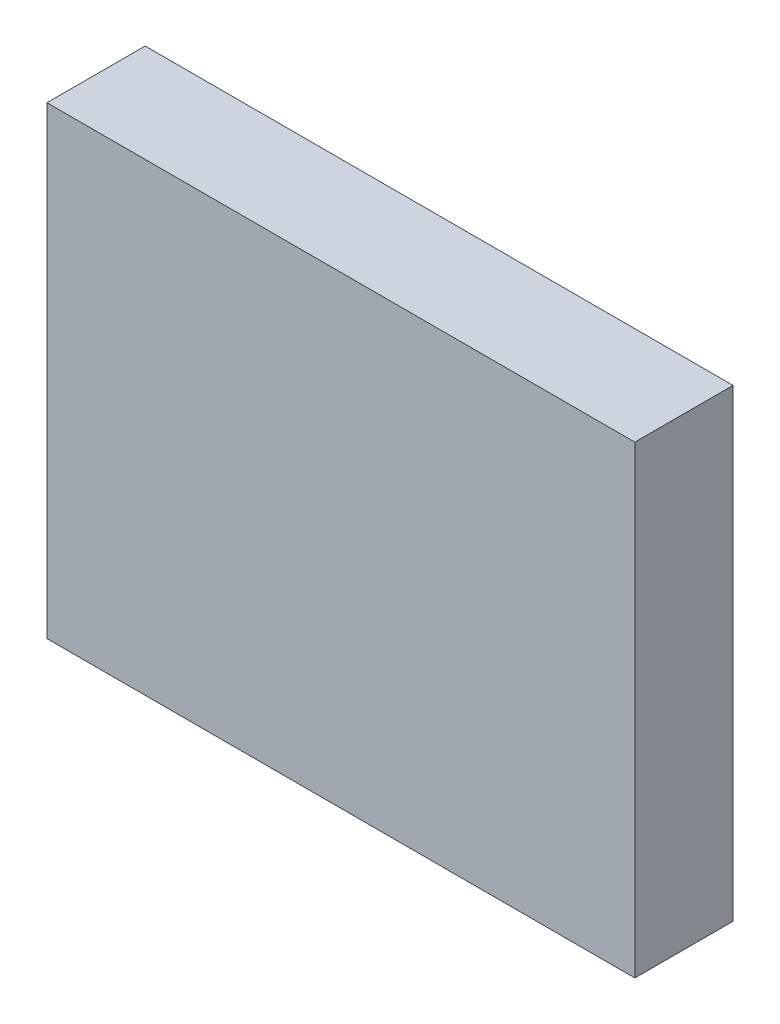
ISO-10303-21;
HEADER;
FILE_DESCRIPTION(('STEP AP214'),'2;1');
FILE_NAME('part.step','',(''),(''),'','','');
FILE_SCHEMA(('AUTOMOTIVE_DESIGN { 1 0 10303 214 1 1 1 1 }'));
ENDSEC;
DATA;
#1=APPLICATION_CONTEXT('core data for automotive mechanical design processes');
#2=APPLICATION_PROTOCOL_DEFINITION('international standard','automotive_design',2000,#1);
#3=PRODUCT_CONTEXT('',#1,'mechanical');
#4=PRODUCT('Part','Part','',(#3));
#5=PRODUCT_RELATED_PRODUCT_CATEGORY('part','',(#4));
#6=PRODUCT_DEFINITION_FORMATION('','',#4);
#7=PRODUCT_DEFINITION_CONTEXT('part definition',#1,'design');
#8=PRODUCT_DEFINITION('design','',#6,#7);
#9=PRODUCT_DEFINITION_SHAPE('','',#8);
#10=(LENGTH_UNIT() NAMED_UNIT(*) SI_UNIT(.MILLI.,.METRE.));
#11=(NAMED_UNIT(*) PLANE_ANGLE_UNIT() SI_UNIT($,.RADIAN.));
#12=(NAMED_UNIT(*) SI_UNIT($,.STERADIAN.) SOLID_ANGLE_UNIT());
#13=UNCERTAINTY_MEASURE_WITH_UNIT(LENGTH_MEASURE(1.E-05),#10,'distance_accuracy_value','');
#14=(GEOMETRIC_REPRESENTATION_CONTEXT(3) GLOBAL_UNCERTAINTY_ASSIGNED_CONTEXT((#13)) GLOBAL_UNIT_ASSIGNED_CONTEXT((#10,
#11,#12)) REPRESENTATION_CONTEXT('',''));
#15=CARTESIAN_POINT('',(0.,0.,0.));
#16=DIRECTION('',(0.,0.,1.));
#17=DIRECTION('',(1.,0.,0.));
#18=AXIS2_PLACEMENT_3D('',#15,#16,#17);
#19=CARTESIAN_POINT('',(19.,-15.,6.35));
#20=DIRECTION('',(-1.,0.,0.));
#21=DIRECTION('',(0.,0.,1.));
#22=AXIS2_PLACEMENT_3D('',#19,#20,#21);
#23=PLANE('',#22);
#24=DIRECTION('',(0.,1.,0.));
#25=VECTOR('',#24,1.);
#26=CARTESIAN_POINT('',(19.,-15.,0.));
#27=LINE('',#26,#25);
#28=CARTESIAN_POINT('',(19.,-15.,0.));
#29=VERTEX_POINT('',#28);
#30=CARTESIAN_POINT('',(19.,15.,0.));
#31=VERTEX_POINT('',#30);
#32=EDGE_CURVE('E96',#29,#31,#27,.T.);
#33=ORIENTED_EDGE('',*,*,#32,.T.);
#34=DIRECTION('',(0.,0.,-1.));
#35=VECTOR('',#34,1.);
#36=CARTESIAN_POINT('',(19.,15.,6.35));
#37=LINE('',#36,#35);
#38=CARTESIAN_POINT('',(19.,15.,6.35));
#39=VERTEX_POINT('',#38);
#40=EDGE_CURVE('E11',#39,#31,#37,.T.);
#41=ORIENTED_EDGE('',*,*,#40,.F.);
#42=DIRECTION('',(0.,1.,0.));
#43=VECTOR('',#42,1.);
#44=CARTESIAN_POINT('',(19.,-15.,6.35));
#45=LINE('',#44,#43);
#46=CARTESIAN_POINT('',(19.,-15.,6.35));
#47=VERTEX_POINT('',#46);
#48=EDGE_CURVE('E84',#47,#39,#45,.T.);
#49=ORIENTED_EDGE('',*,*,#48,.F.);
#50=DIRECTION('',(0.,0.,-1.));
#51=VECTOR('',#50,1.);
#52=CARTESIAN_POINT('',(19.,-15.,6.35));
#53=LINE('',#52,#51);
#54=EDGE_CURVE('E92',#47,#29,#53,.T.);
#55=ORIENTED_EDGE('',*,*,#54,.T.);
#56=EDGE_LOOP('',(#33,#41,#49,#55));
#57=FACE_BOUND('',#56,.T.);
#58=ADVANCED_FACE('F33',(#57),#23,.F.);
#59=CARTESIAN_POINT('',(-19.,15.,6.35));
#60=DIRECTION('',(0.,-1.,0.));
#61=DIRECTION('',(0.,0.,-1.));
#62=AXIS2_PLACEMENT_3D('',#59,#60,#61);
#63=PLANE('',#62);
#64=DIRECTION('',(-1.,0.,0.));
#65=VECTOR('',#64,1.);
#66=CARTESIAN_POINT('',(-19.,15.,0.));
#67=LINE('',#66,#65);
#68=CARTESIAN_POINT('',(-19.,15.,0.));
#69=VERTEX_POINT('',#68);
#70=EDGE_CURVE('E88',#31,#69,#67,.T.);
#71=ORIENTED_EDGE('',*,*,#70,.T.);
#72=DIRECTION('',(0.,0.,-1.));
#73=VECTOR('',#72,1.);
#74=CARTESIAN_POINT('',(-19.,15.,6.35));
#75=LINE('',#74,#73);
#76=CARTESIAN_POINT('',(-19.,15.,6.35));
#77=VERTEX_POINT('',#76);
#78=EDGE_CURVE('E41',#77,#69,#75,.T.);
#79=ORIENTED_EDGE('',*,*,#78,.F.);
#80=DIRECTION('',(-1.,0.,0.));
#81=VECTOR('',#80,1.);
#82=CARTESIAN_POINT('',(-19.,15.,6.35));
#83=LINE('',#82,#81);
#84=EDGE_CURVE('E79',#39,#77,#83,.T.);
#85=ORIENTED_EDGE('',*,*,#84,.F.);
#86=ORIENTED_EDGE('',*,*,#40,.T.);
#87=EDGE_LOOP('',(#71,#79,#85,#86));
#88=FACE_BOUND('',#87,.T.);
#89=ADVANCED_FACE('F87',(#88),#63,.F.);
#90=CARTESIAN_POINT('',(-19.,-15.,6.35));
#91=DIRECTION('',(1.,0.,0.));
#92=DIRECTION('',(0.,0.,-1.));
#93=AXIS2_PLACEMENT_3D('',#90,#91,#92);
#94=PLANE('',#93);
#95=DIRECTION('',(0.,-1.,0.));
#96=VECTOR('',#95,1.);
#97=CARTESIAN_POINT('',(-19.,-15.,0.));
#98=LINE('',#97,#96);
#99=CARTESIAN_POINT('',(-19.,-15.,0.));
#100=VERTEX_POINT('',#99);
#101=EDGE_CURVE('E66',#69,#100,#98,.T.);
#102=ORIENTED_EDGE('',*,*,#101,.T.);
#103=DIRECTION('',(0.,0.,-1.));
#104=VECTOR('',#103,1.);
#105=CARTESIAN_POINT('',(-19.,-15.,6.35));
#106=LINE('',#105,#104);
#107=CARTESIAN_POINT('',(-19.,-15.,6.35));
#108=VERTEX_POINT('',#107);
#109=EDGE_CURVE('E89',#108,#100,#106,.T.);
#110=ORIENTED_EDGE('',*,*,#109,.F.);
#111=DIRECTION('',(0.,-1.,0.));
#112=VECTOR('',#111,1.);
#113=CARTESIAN_POINT('',(-19.,-15.,6.35));
#114=LINE('',#113,#112);
#115=EDGE_CURVE('E82',#77,#108,#114,.T.);
#116=ORIENTED_EDGE('',*,*,#115,.F.);
#117=ORIENTED_EDGE('',*,*,#78,.T.);
#118=EDGE_LOOP('',(#102,#110,#116,#117));
#119=FACE_BOUND('',#118,.T.);
#120=ADVANCED_FACE('F90',(#119),#94,.F.);
#121=CARTESIAN_POINT('',(-19.,-15.,6.35));
#122=DIRECTION('',(0.,1.,0.));
#123=DIRECTION('',(0.,0.,1.));
#124=AXIS2_PLACEMENT_3D('',#121,#122,#123);
#125=PLANE('',#124);
#126=DIRECTION('',(1.,0.,0.));
#127=VECTOR('',#126,1.);
#128=CARTESIAN_POINT('',(-19.,-15.,0.));
#129=LINE('',#128,#127);
#130=EDGE_CURVE('E72',#100,#29,#129,.T.);
#131=ORIENTED_EDGE('',*,*,#130,.T.);
#132=ORIENTED_EDGE('',*,*,#54,.F.);
#133=DIRECTION('',(1.,0.,0.));
#134=VECTOR('',#133,1.);
#135=CARTESIAN_POINT('',(-19.,-15.,6.35));
#136=LINE('',#135,#134);
#137=EDGE_CURVE('E49',#108,#47,#136,.T.);
#138=ORIENTED_EDGE('',*,*,#137,.F.);
#139=ORIENTED_EDGE('',*,*,#109,.T.);
#140=EDGE_LOOP('',(#131,#132,#138,#139));
#141=FACE_BOUND('',#140,.T.);
#142=ADVANCED_FACE('F103',(#141),#125,.F.);
#143=CARTESIAN_POINT('',(0.,0.,6.35));
#144=DIRECTION('',(0.,0.,-1.));
#145=DIRECTION('',(-1.,0.,0.));
#146=AXIS2_PLACEMENT_3D('',#143,#144,#145);
#147=PLANE('',#146);
#148=ORIENTED_EDGE('',*,*,#48,.T.);
#149=ORIENTED_EDGE('',*,*,#84,.T.);
#150=ORIENTED_EDGE('',*,*,#115,.T.);
#151=ORIENTED_EDGE('',*,*,#137,.T.);
#152=EDGE_LOOP('',(#148,#149,#150,#151));
#153=FACE_BOUND('',#152,.T.);
#154=ADVANCED_FACE('F80',(#153),#147,.F.);
#155=CARTESIAN_POINT('',(0.,0.,0.));
#156=DIRECTION('',(0.,0.,-1.));
#157=DIRECTION('',(-1.,0.,0.));
#158=AXIS2_PLACEMENT_3D('',#155,#156,#157);
#159=PLANE('',#158);
#160=ORIENTED_EDGE('',*,*,#32,.F.);
#161=ORIENTED_EDGE('',*,*,#130,.F.);
#162=ORIENTED_EDGE('',*,*,#101,.F.);
#163=ORIENTED_EDGE('',*,*,#70,.F.);
#164=EDGE_LOOP('',(#160,#161,#162,#163));
#165=FACE_BOUND('',#164,.T.);
#166=ADVANCED_FACE('F106',(#165),#159,.T.);
#167=CLOSED_SHELL('',(#58,#89,#120,#142,#154,#166));
#168=MANIFOLD_SOLID_BREP('B2',#167);
#169=ADVANCED_BREP_SHAPE_REPRESENTATION('',(#18,#168),#14);
#170=SHAPE_DEFINITION_REPRESENTATION(#9,#169);
ENDSEC;
END-ISO-10303-21;
